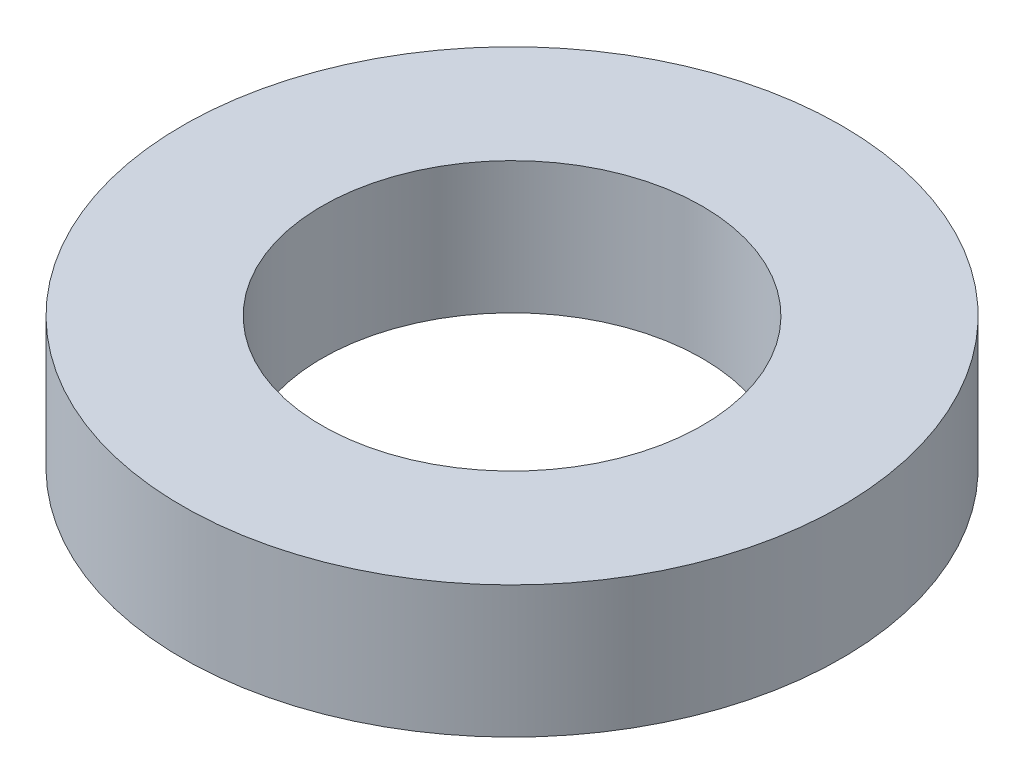
ISO-10303-21;
HEADER;
FILE_DESCRIPTION(('STEP AP214'),'2;1');
FILE_NAME('part.step','',(''),(''),'','','');
FILE_SCHEMA(('AUTOMOTIVE_DESIGN { 1 0 10303 214 1 1 1 1 }'));
ENDSEC;
DATA;
#1=APPLICATION_CONTEXT('core data for automotive mechanical design processes');
#2=APPLICATION_PROTOCOL_DEFINITION('international standard','automotive_design',2000,#1);
#3=PRODUCT_CONTEXT('',#1,'mechanical');
#4=PRODUCT('Part','Part','',(#3));
#5=PRODUCT_RELATED_PRODUCT_CATEGORY('part','',(#4));
#6=PRODUCT_DEFINITION_FORMATION('','',#4);
#7=PRODUCT_DEFINITION_CONTEXT('part definition',#1,'design');
#8=PRODUCT_DEFINITION('design','',#6,#7);
#9=PRODUCT_DEFINITION_SHAPE('','',#8);
#10=(LENGTH_UNIT() NAMED_UNIT(*) SI_UNIT(.MILLI.,.METRE.));
#11=(NAMED_UNIT(*) PLANE_ANGLE_UNIT() SI_UNIT($,.RADIAN.));
#12=(NAMED_UNIT(*) SI_UNIT($,.STERADIAN.) SOLID_ANGLE_UNIT());
#13=UNCERTAINTY_MEASURE_WITH_UNIT(LENGTH_MEASURE(1.E-05),#10,'distance_accuracy_value','');
#14=(GEOMETRIC_REPRESENTATION_CONTEXT(3) GLOBAL_UNCERTAINTY_ASSIGNED_CONTEXT((#13)) GLOBAL_UNIT_ASSIGNED_CONTEXT((#10,
#11,#12)) REPRESENTATION_CONTEXT('',''));
#15=CARTESIAN_POINT('',(0.,0.,0.));
#16=DIRECTION('',(0.,0.,1.));
#17=DIRECTION('',(1.,0.,0.));
#18=AXIS2_PLACEMENT_3D('',#15,#16,#17);
#19=CARTESIAN_POINT('',(0.,26.,0.));
#20=DIRECTION('',(0.,-1.,0.));
#21=DIRECTION('',(0.,0.,-1.));
#22=AXIS2_PLACEMENT_3D('',#19,#20,#21);
#23=CYLINDRICAL_SURFACE('',#22,65.);
#24=CARTESIAN_POINT('',(0.,26.,0.));
#25=DIRECTION('',(0.,1.,0.));
#26=DIRECTION('',(0.,0.,1.));
#27=AXIS2_PLACEMENT_3D('',#24,#25,#26);
#28=CIRCLE('',#27,65.);
#29=CARTESIAN_POINT('',(0.,26.,-65.));
#30=VERTEX_POINT('',#29);
#31=EDGE_CURVE('E10',#30,#30,#28,.T.);
#32=CARTESIAN_POINT('',(0.,0.,0.));
#33=DIRECTION('',(0.,1.,0.));
#34=DIRECTION('',(0.,0.,1.));
#35=AXIS2_PLACEMENT_3D('',#32,#33,#34);
#36=CIRCLE('',#35,65.);
#37=CARTESIAN_POINT('',(0.,0.,-65.));
#38=VERTEX_POINT('',#37);
#39=EDGE_CURVE('E37',#38,#38,#36,.T.);
#40=CARTESIAN_POINT('',(0.,26.,-65.));
#41=CARTESIAN_POINT('',(0.,25.7291666666667,-65.));
#42=CARTESIAN_POINT('',(0.,25.4583333333333,-65.));
#43=CARTESIAN_POINT('',(0.,24.9166666666667,-65.));
#44=CARTESIAN_POINT('',(0.,24.6458333333333,-65.));
#45=CARTESIAN_POINT('',(0.,24.1041666666667,-65.));
#46=CARTESIAN_POINT('',(0.,23.8333333333333,-65.));
#47=CARTESIAN_POINT('',(0.,23.2916666666667,-65.));
#48=CARTESIAN_POINT('',(0.,23.0208333333333,-65.));
#49=CARTESIAN_POINT('',(0.,22.4791666666667,-65.));
#50=CARTESIAN_POINT('',(0.,22.2083333333333,-65.));
#51=CARTESIAN_POINT('',(0.,21.6666666666667,-65.));
#52=CARTESIAN_POINT('',(0.,21.3958333333333,-65.));
#53=CARTESIAN_POINT('',(0.,20.8541666666667,-65.));
#54=CARTESIAN_POINT('',(0.,20.5833333333333,-65.));
#55=CARTESIAN_POINT('',(0.,20.0416666666667,-65.));
#56=CARTESIAN_POINT('',(0.,19.7708333333333,-65.));
#57=CARTESIAN_POINT('',(0.,19.2291666666667,-65.));
#58=CARTESIAN_POINT('',(0.,18.9583333333333,-65.));
#59=CARTESIAN_POINT('',(0.,18.4166666666667,-65.));
#60=CARTESIAN_POINT('',(0.,18.1458333333333,-65.));
#61=CARTESIAN_POINT('',(0.,17.6041666666667,-65.));
#62=CARTESIAN_POINT('',(0.,17.3333333333333,-65.));
#63=CARTESIAN_POINT('',(0.,16.7916666666667,-65.));
#64=CARTESIAN_POINT('',(0.,16.5208333333333,-65.));
#65=CARTESIAN_POINT('',(0.,15.9791666666667,-65.));
#66=CARTESIAN_POINT('',(0.,15.7083333333333,-65.));
#67=CARTESIAN_POINT('',(0.,15.1666666666667,-65.));
#68=CARTESIAN_POINT('',(0.,14.8958333333333,-65.));
#69=CARTESIAN_POINT('',(0.,14.3541666666667,-65.));
#70=CARTESIAN_POINT('',(0.,14.0833333333333,-65.));
#71=CARTESIAN_POINT('',(0.,13.5416666666667,-65.));
#72=CARTESIAN_POINT('',(0.,13.2708333333333,-65.));
#73=CARTESIAN_POINT('',(0.,12.7291666666667,-65.));
#74=CARTESIAN_POINT('',(0.,12.4583333333333,-65.));
#75=CARTESIAN_POINT('',(0.,11.9166666666667,-65.));
#76=CARTESIAN_POINT('',(0.,11.6458333333333,-65.));
#77=CARTESIAN_POINT('',(0.,11.1041666666667,-65.));
#78=CARTESIAN_POINT('',(0.,10.8333333333333,-65.));
#79=CARTESIAN_POINT('',(0.,10.2916666666667,-65.));
#80=CARTESIAN_POINT('',(0.,10.0208333333333,-65.));
#81=CARTESIAN_POINT('',(0.,9.47916666666667,-65.));
#82=CARTESIAN_POINT('',(0.,9.20833333333333,-65.));
#83=CARTESIAN_POINT('',(0.,8.66666666666667,-65.));
#84=CARTESIAN_POINT('',(0.,8.39583333333333,-65.));
#85=CARTESIAN_POINT('',(0.,7.85416666666667,-65.));
#86=CARTESIAN_POINT('',(0.,7.58333333333333,-65.));
#87=CARTESIAN_POINT('',(0.,7.04166666666667,-65.));
#88=CARTESIAN_POINT('',(0.,6.77083333333333,-65.));
#89=CARTESIAN_POINT('',(0.,6.22916666666667,-65.));
#90=CARTESIAN_POINT('',(0.,5.95833333333333,-65.));
#91=CARTESIAN_POINT('',(0.,5.41666666666667,-65.));
#92=CARTESIAN_POINT('',(0.,5.14583333333333,-65.));
#93=CARTESIAN_POINT('',(0.,4.60416666666667,-65.));
#94=CARTESIAN_POINT('',(0.,4.33333333333333,-65.));
#95=CARTESIAN_POINT('',(0.,3.79166666666667,-65.));
#96=CARTESIAN_POINT('',(0.,3.52083333333333,-65.));
#97=CARTESIAN_POINT('',(0.,2.97916666666667,-65.));
#98=CARTESIAN_POINT('',(0.,2.70833333333333,-65.));
#99=CARTESIAN_POINT('',(0.,2.16666666666667,-65.));
#100=CARTESIAN_POINT('',(0.,1.89583333333333,-65.));
#101=CARTESIAN_POINT('',(0.,1.35416666666667,-65.));
#102=CARTESIAN_POINT('',(0.,1.08333333333333,-65.));
#103=CARTESIAN_POINT('',(0.,0.541666666666667,-65.));
#104=CARTESIAN_POINT('',(0.,0.270833333333334,-65.));
#105=CARTESIAN_POINT('',(0.,0.,-65.));
#106=B_SPLINE_CURVE_WITH_KNOTS('',3,(#40,#41,#42,#43,#44,#45,#46,#47,#48,#49,#50,#51,#52,#53,
#54,#55,#56,#57,#58,#59,#60,#61,#62,#63,#64,#65,#66,#67,#68,#69,#70,#71,#72,#73,#74,#75,#76,#77,
#78,#79,#80,#81,#82,#83,#84,#85,#86,#87,#88,#89,#90,#91,#92,#93,#94,#95,#96,#97,#98,#99,#100,
#101,#102,#103,#104,#105),.UNSPECIFIED.,.F.,.F.,(4,2,2,2,2,2,2,2,2,2,2,2,2,2,2,2,2,2,2,2,2,2,2,
2,2,2,2,2,2,2,2,2,4),(0.,0.812499999999997,1.625,2.4375,3.25,4.0625,4.875,5.6875,6.5,7.3125,
8.125,8.93749999999999,9.74999999999999,10.5625,11.375,12.1875,13.,13.8125,14.625,15.4375,16.25,
17.0625,17.875,18.6875,19.5,20.3125,21.125,21.9375,22.75,23.5625,24.375,25.1875,26.),.UNSPECIFIED.);
#107=EDGE_CURVE('BSEAM40',#30,#38,#106,.T.);
#108=ORIENTED_EDGE('',*,*,#31,.F.);
#109=ORIENTED_EDGE('',*,*,#39,.T.);
#110=ORIENTED_EDGE('',*,*,#107,.T.);
#111=ORIENTED_EDGE('',*,*,#107,.F.);
#112=EDGE_LOOP('',(#108,#110,#109,#111));
#113=FACE_BOUND('',#112,.T.);
#114=ADVANCED_FACE('F40',(#113),#23,.T.);
#115=CARTESIAN_POINT('',(0.,26.,0.));
#116=DIRECTION('',(0.,1.,0.));
#117=DIRECTION('',(0.,0.,1.));
#118=AXIS2_PLACEMENT_3D('',#115,#116,#117);
#119=PLANE('',#118);
#120=CARTESIAN_POINT('',(0.,26.,0.));
#121=DIRECTION('',(0.,1.,0.));
#122=DIRECTION('',(0.,0.,1.));
#123=AXIS2_PLACEMENT_3D('',#120,#121,#122);
#124=CIRCLE('',#123,37.5);
#125=CARTESIAN_POINT('',(0.,26.,-37.5));
#126=VERTEX_POINT('',#125);
#127=EDGE_CURVE('E50',#126,#126,#124,.T.);
#128=ORIENTED_EDGE('',*,*,#127,.F.);
#129=EDGE_LOOP('',(#128));
#130=FACE_BOUND('',#129,.T.);
#131=ORIENTED_EDGE('',*,*,#31,.T.);
#132=EDGE_LOOP('',(#131));
#133=FACE_BOUND('',#132,.T.);
#134=ADVANCED_FACE('F59',(#130,#133),#119,.T.);
#135=CARTESIAN_POINT('',(0.,0.,0.));
#136=DIRECTION('',(0.,1.,0.));
#137=DIRECTION('',(0.,0.,1.));
#138=AXIS2_PLACEMENT_3D('',#135,#136,#137);
#139=PLANE('',#138);
#140=CARTESIAN_POINT('',(0.,0.,0.));
#141=DIRECTION('',(0.,1.,0.));
#142=DIRECTION('',(0.,0.,1.));
#143=AXIS2_PLACEMENT_3D('',#140,#141,#142);
#144=CIRCLE('',#143,37.5);
#145=CARTESIAN_POINT('',(0.,0.,-37.5));
#146=VERTEX_POINT('',#145);
#147=EDGE_CURVE('E47',#146,#146,#144,.T.);
#148=ORIENTED_EDGE('',*,*,#147,.T.);
#149=EDGE_LOOP('',(#148));
#150=FACE_BOUND('',#149,.T.);
#151=ORIENTED_EDGE('',*,*,#39,.F.);
#152=EDGE_LOOP('',(#151));
#153=FACE_BOUND('',#152,.T.);
#154=ADVANCED_FACE('F58',(#150,#153),#139,.F.);
#155=CARTESIAN_POINT('',(0.,26.,0.));
#156=DIRECTION('',(0.,-1.,0.));
#157=DIRECTION('',(0.,0.,-1.));
#158=AXIS2_PLACEMENT_3D('',#155,#156,#157);
#159=CYLINDRICAL_SURFACE('',#158,37.5);
#160=CARTESIAN_POINT('',(0.,26.,-37.5));
#161=CARTESIAN_POINT('',(0.,25.7291666666667,-37.5));
#162=CARTESIAN_POINT('',(0.,25.4583333333333,-37.5));
#163=CARTESIAN_POINT('',(0.,24.9166666666667,-37.5));
#164=CARTESIAN_POINT('',(0.,24.6458333333333,-37.5));
#165=CARTESIAN_POINT('',(0.,24.1041666666667,-37.5));
#166=CARTESIAN_POINT('',(0.,23.8333333333333,-37.5));
#167=CARTESIAN_POINT('',(0.,23.2916666666667,-37.5));
#168=CARTESIAN_POINT('',(0.,23.0208333333333,-37.5));
#169=CARTESIAN_POINT('',(0.,22.4791666666667,-37.5));
#170=CARTESIAN_POINT('',(0.,22.2083333333333,-37.5));
#171=CARTESIAN_POINT('',(0.,21.6666666666667,-37.5));
#172=CARTESIAN_POINT('',(0.,21.3958333333333,-37.5));
#173=CARTESIAN_POINT('',(0.,20.8541666666667,-37.5));
#174=CARTESIAN_POINT('',(0.,20.5833333333333,-37.5));
#175=CARTESIAN_POINT('',(0.,20.0416666666667,-37.5));
#176=CARTESIAN_POINT('',(0.,19.7708333333333,-37.5));
#177=CARTESIAN_POINT('',(0.,19.2291666666667,-37.5));
#178=CARTESIAN_POINT('',(0.,18.9583333333333,-37.5));
#179=CARTESIAN_POINT('',(0.,18.4166666666667,-37.5));
#180=CARTESIAN_POINT('',(0.,18.1458333333333,-37.5));
#181=CARTESIAN_POINT('',(0.,17.6041666666667,-37.5));
#182=CARTESIAN_POINT('',(0.,17.3333333333333,-37.5));
#183=CARTESIAN_POINT('',(0.,16.7916666666667,-37.5));
#184=CARTESIAN_POINT('',(0.,16.5208333333333,-37.5));
#185=CARTESIAN_POINT('',(0.,15.9791666666667,-37.5));
#186=CARTESIAN_POINT('',(0.,15.7083333333333,-37.5));
#187=CARTESIAN_POINT('',(0.,15.1666666666667,-37.5));
#188=CARTESIAN_POINT('',(0.,14.8958333333333,-37.5));
#189=CARTESIAN_POINT('',(0.,14.3541666666667,-37.5));
#190=CARTESIAN_POINT('',(0.,14.0833333333333,-37.5));
#191=CARTESIAN_POINT('',(0.,13.5416666666667,-37.5));
#192=CARTESIAN_POINT('',(0.,13.2708333333333,-37.5));
#193=CARTESIAN_POINT('',(0.,12.7291666666667,-37.5));
#194=CARTESIAN_POINT('',(0.,12.4583333333333,-37.5));
#195=CARTESIAN_POINT('',(0.,11.9166666666667,-37.5));
#196=CARTESIAN_POINT('',(0.,11.6458333333333,-37.5));
#197=CARTESIAN_POINT('',(0.,11.1041666666667,-37.5));
#198=CARTESIAN_POINT('',(0.,10.8333333333333,-37.5));
#199=CARTESIAN_POINT('',(0.,10.2916666666667,-37.5));
#200=CARTESIAN_POINT('',(0.,10.0208333333333,-37.5));
#201=CARTESIAN_POINT('',(0.,9.47916666666667,-37.5));
#202=CARTESIAN_POINT('',(0.,9.20833333333333,-37.5));
#203=CARTESIAN_POINT('',(0.,8.66666666666667,-37.5));
#204=CARTESIAN_POINT('',(0.,8.39583333333333,-37.5));
#205=CARTESIAN_POINT('',(0.,7.85416666666667,-37.5));
#206=CARTESIAN_POINT('',(0.,7.58333333333333,-37.5));
#207=CARTESIAN_POINT('',(0.,7.04166666666667,-37.5));
#208=CARTESIAN_POINT('',(0.,6.77083333333333,-37.5));
#209=CARTESIAN_POINT('',(0.,6.22916666666667,-37.5));
#210=CARTESIAN_POINT('',(0.,5.95833333333333,-37.5));
#211=CARTESIAN_POINT('',(0.,5.41666666666667,-37.5));
#212=CARTESIAN_POINT('',(0.,5.14583333333333,-37.5));
#213=CARTESIAN_POINT('',(0.,4.60416666666667,-37.5));
#214=CARTESIAN_POINT('',(0.,4.33333333333333,-37.5));
#215=CARTESIAN_POINT('',(0.,3.79166666666667,-37.5));
#216=CARTESIAN_POINT('',(0.,3.52083333333333,-37.5));
#217=CARTESIAN_POINT('',(0.,2.97916666666667,-37.5));
#218=CARTESIAN_POINT('',(0.,2.70833333333333,-37.5));
#219=CARTESIAN_POINT('',(0.,2.16666666666667,-37.5));
#220=CARTESIAN_POINT('',(0.,1.89583333333333,-37.5));
#221=CARTESIAN_POINT('',(0.,1.35416666666667,-37.5));
#222=CARTESIAN_POINT('',(0.,1.08333333333333,-37.5));
#223=CARTESIAN_POINT('',(0.,0.541666666666667,-37.5));
#224=CARTESIAN_POINT('',(0.,0.270833333333334,-37.5));
#225=CARTESIAN_POINT('',(0.,0.,-37.5));
#226=B_SPLINE_CURVE_WITH_KNOTS('',3,(#160,#161,#162,#163,#164,#165,#166,#167,#168,#169,#170,
#171,#172,#173,#174,#175,#176,#177,#178,#179,#180,#181,#182,#183,#184,#185,#186,#187,#188,#189,
#190,#191,#192,#193,#194,#195,#196,#197,#198,#199,#200,#201,#202,#203,#204,#205,#206,#207,#208,
#209,#210,#211,#212,#213,#214,#215,#216,#217,#218,#219,#220,#221,#222,#223,#224,#225),
.UNSPECIFIED.,.F.,.F.,(4,2,2,2,2,2,2,2,2,2,2,2,2,2,2,2,2,2,2,2,2,2,2,2,2,2,2,2,2,2,2,2,4),(0.,
0.812499999999997,1.625,2.4375,3.25,4.0625,4.875,5.6875,6.5,7.3125,8.125,8.93749999999999,
9.74999999999999,10.5625,11.375,12.1875,13.,13.8125,14.625,15.4375,16.25,17.0625,17.875,18.6875,
19.5,20.3125,21.125,21.9375,22.75,23.5625,24.375,25.1875,26.),.UNSPECIFIED.);
#227=EDGE_CURVE('BSEAM54',#126,#146,#226,.T.);
#228=ORIENTED_EDGE('',*,*,#127,.T.);
#229=ORIENTED_EDGE('',*,*,#147,.F.);
#230=ORIENTED_EDGE('',*,*,#227,.T.);
#231=ORIENTED_EDGE('',*,*,#227,.F.);
#232=EDGE_LOOP('',(#228,#230,#229,#231));
#233=FACE_BOUND('',#232,.T.);
#234=ADVANCED_FACE('F54',(#233),#159,.F.);
#235=CLOSED_SHELL('',(#114,#134,#154,#234));
#236=MANIFOLD_SOLID_BREP('B2',#235);
#237=ADVANCED_BREP_SHAPE_REPRESENTATION('',(#18,#236),#14);
#238=SHAPE_DEFINITION_REPRESENTATION(#9,#237);
ENDSEC;
END-ISO-10303-21;
